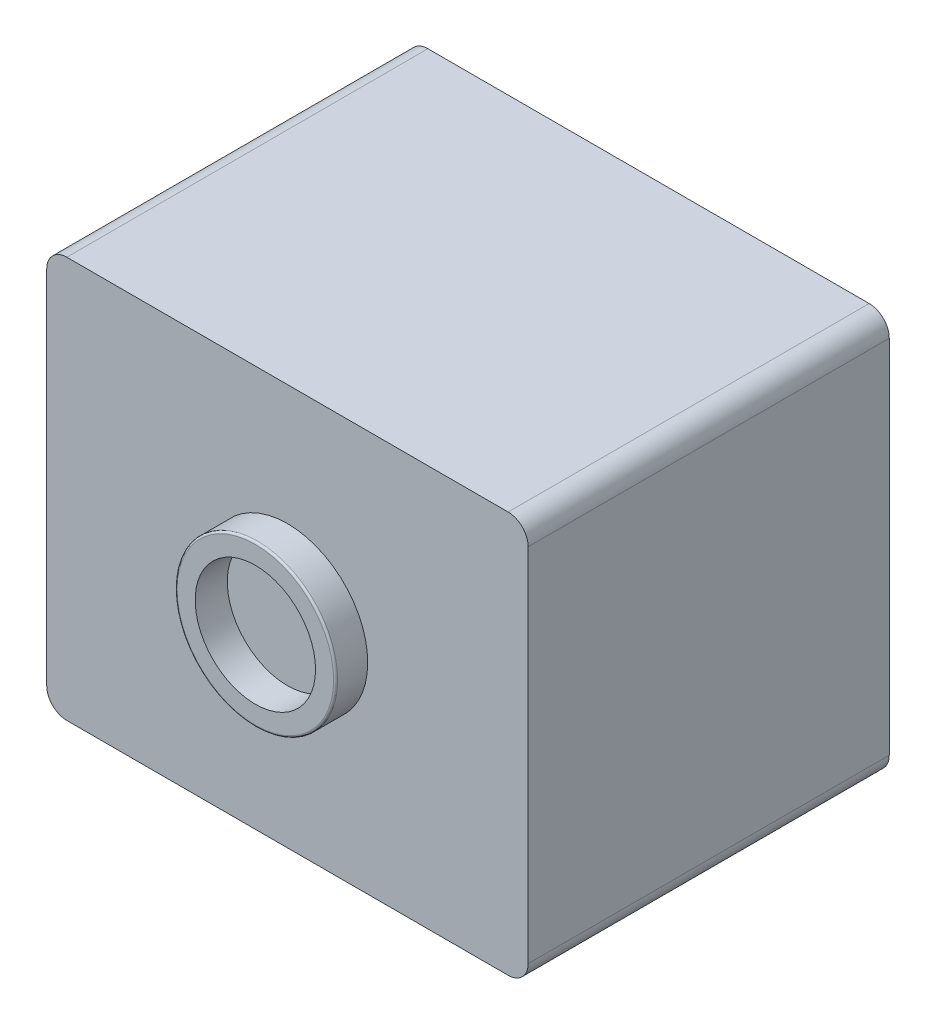
ISO-10303-21;
HEADER;
FILE_DESCRIPTION(('STEP AP214'),'2;1');
FILE_NAME('part.step','',(''),(''),'','','');
FILE_SCHEMA(('AUTOMOTIVE_DESIGN { 1 0 10303 214 1 1 1 1 }'));
ENDSEC;
DATA;
#1=APPLICATION_CONTEXT('core data for automotive mechanical design processes');
#2=APPLICATION_PROTOCOL_DEFINITION('international standard','automotive_design',2000,#1);
#3=PRODUCT_CONTEXT('',#1,'mechanical');
#4=PRODUCT('Part','Part','',(#3));
#5=PRODUCT_RELATED_PRODUCT_CATEGORY('part','',(#4));
#6=PRODUCT_DEFINITION_FORMATION('','',#4);
#7=PRODUCT_DEFINITION_CONTEXT('part definition',#1,'design');
#8=PRODUCT_DEFINITION('design','',#6,#7);
#9=PRODUCT_DEFINITION_SHAPE('','',#8);
#10=(LENGTH_UNIT() NAMED_UNIT(*) SI_UNIT(.MILLI.,.METRE.));
#11=(NAMED_UNIT(*) PLANE_ANGLE_UNIT() SI_UNIT($,.RADIAN.));
#12=(NAMED_UNIT(*) SI_UNIT($,.STERADIAN.) SOLID_ANGLE_UNIT());
#13=UNCERTAINTY_MEASURE_WITH_UNIT(LENGTH_MEASURE(1.E-05),#10,'distance_accuracy_value','');
#14=(GEOMETRIC_REPRESENTATION_CONTEXT(3) GLOBAL_UNCERTAINTY_ASSIGNED_CONTEXT((#13)) GLOBAL_UNIT_ASSIGNED_CONTEXT((#10,
#11,#12)) REPRESENTATION_CONTEXT('',''));
#15=CARTESIAN_POINT('',(0.,0.,0.));
#16=DIRECTION('',(0.,0.,1.));
#17=DIRECTION('',(1.,0.,0.));
#18=AXIS2_PLACEMENT_3D('',#15,#16,#17);
#19=CARTESIAN_POINT('',(6.,-5.,9.));
#20=DIRECTION('',(-1.,0.,0.));
#21=DIRECTION('',(0.,0.,1.));
#22=AXIS2_PLACEMENT_3D('',#19,#20,#21);
#23=PLANE('',#22);
#24=DIRECTION('',(0.,1.,0.));
#25=VECTOR('',#24,1.);
#26=CARTESIAN_POINT('',(6.,-5.,9.));
#27=LINE('',#26,#25);
#28=CARTESIAN_POINT('',(6.,-4.5,9.));
#29=VERTEX_POINT('',#28);
#30=CARTESIAN_POINT('',(6.,4.5,9.));
#31=VERTEX_POINT('',#30);
#32=EDGE_CURVE('E123',#29,#31,#27,.T.);
#33=ORIENTED_EDGE('',*,*,#32,.F.);
#34=DIRECTION('',(0.,0.,-1.));
#35=VECTOR('',#34,1.);
#36=CARTESIAN_POINT('',(6.,-4.5,9.));
#37=LINE('',#36,#35);
#38=CARTESIAN_POINT('',(6.,-4.5,0.));
#39=VERTEX_POINT('',#38);
#40=EDGE_CURVE('E108',#29,#39,#37,.T.);
#41=ORIENTED_EDGE('',*,*,#40,.T.);
#42=DIRECTION('',(0.,1.,0.));
#43=VECTOR('',#42,1.);
#44=CARTESIAN_POINT('',(6.,-5.,0.));
#45=LINE('',#44,#43);
#46=CARTESIAN_POINT('',(6.,4.5,0.));
#47=VERTEX_POINT('',#46);
#48=EDGE_CURVE('E120',#39,#47,#45,.T.);
#49=ORIENTED_EDGE('',*,*,#48,.T.);
#50=DIRECTION('',(0.,0.,-1.));
#51=VECTOR('',#50,1.);
#52=CARTESIAN_POINT('',(6.,4.5,9.));
#53=LINE('',#52,#51);
#54=EDGE_CURVE('E125',#47,#31,#53,.F.);
#55=ORIENTED_EDGE('',*,*,#54,.T.);
#56=EDGE_LOOP('',(#33,#41,#49,#55));
#57=FACE_BOUND('',#56,.T.);
#58=ADVANCED_FACE('F37',(#57),#23,.F.);
#59=CARTESIAN_POINT('',(-6.,5.,9.));
#60=DIRECTION('',(0.,-1.,0.));
#61=DIRECTION('',(0.,0.,-1.));
#62=AXIS2_PLACEMENT_3D('',#59,#60,#61);
#63=PLANE('',#62);
#64=DIRECTION('',(-1.,0.,0.));
#65=VECTOR('',#64,1.);
#66=CARTESIAN_POINT('',(-6.,5.,0.));
#67=LINE('',#66,#65);
#68=CARTESIAN_POINT('',(5.5,5.,0.));
#69=VERTEX_POINT('',#68);
#70=CARTESIAN_POINT('',(-5.5,5.,0.));
#71=VERTEX_POINT('',#70);
#72=EDGE_CURVE('E129',#69,#71,#67,.T.);
#73=ORIENTED_EDGE('',*,*,#72,.T.);
#74=DIRECTION('',(0.,0.,-1.));
#75=VECTOR('',#74,1.);
#76=CARTESIAN_POINT('',(-5.5,5.,9.));
#77=LINE('',#76,#75);
#78=CARTESIAN_POINT('',(-5.5,5.,9.));
#79=VERTEX_POINT('',#78);
#80=EDGE_CURVE('E167',#71,#79,#77,.F.);
#81=ORIENTED_EDGE('',*,*,#80,.T.);
#82=DIRECTION('',(-1.,0.,0.));
#83=VECTOR('',#82,1.);
#84=CARTESIAN_POINT('',(-6.,5.,9.));
#85=LINE('',#84,#83);
#86=CARTESIAN_POINT('',(5.5,5.,9.));
#87=VERTEX_POINT('',#86);
#88=EDGE_CURVE('E225',#87,#79,#85,.T.);
#89=ORIENTED_EDGE('',*,*,#88,.F.);
#90=DIRECTION('',(0.,0.,-1.));
#91=VECTOR('',#90,1.);
#92=CARTESIAN_POINT('',(5.5,5.,9.));
#93=LINE('',#92,#91);
#94=EDGE_CURVE('E164',#87,#69,#93,.T.);
#95=ORIENTED_EDGE('',*,*,#94,.T.);
#96=EDGE_LOOP('',(#73,#81,#89,#95));
#97=FACE_BOUND('',#96,.T.);
#98=ADVANCED_FACE('F194',(#97),#63,.F.);
#99=CARTESIAN_POINT('',(-6.,-5.,9.));
#100=DIRECTION('',(1.,0.,0.));
#101=DIRECTION('',(0.,0.,-1.));
#102=AXIS2_PLACEMENT_3D('',#99,#100,#101);
#103=PLANE('',#102);
#104=DIRECTION('',(0.,-1.,0.));
#105=VECTOR('',#104,1.);
#106=CARTESIAN_POINT('',(-6.,-5.,0.));
#107=LINE('',#106,#105);
#108=CARTESIAN_POINT('',(-6.,4.5,0.));
#109=VERTEX_POINT('',#108);
#110=CARTESIAN_POINT('',(-6.,-4.5,0.));
#111=VERTEX_POINT('',#110);
#112=EDGE_CURVE('E133',#109,#111,#107,.T.);
#113=ORIENTED_EDGE('',*,*,#112,.T.);
#114=DIRECTION('',(0.,0.,-1.));
#115=VECTOR('',#114,1.);
#116=CARTESIAN_POINT('',(-6.,-4.5,9.));
#117=LINE('',#116,#115);
#118=CARTESIAN_POINT('',(-6.,-4.5,9.));
#119=VERTEX_POINT('',#118);
#120=EDGE_CURVE('E52',#111,#119,#117,.F.);
#121=ORIENTED_EDGE('',*,*,#120,.T.);
#122=DIRECTION('',(0.,-1.,0.));
#123=VECTOR('',#122,1.);
#124=CARTESIAN_POINT('',(-6.,-5.,9.));
#125=LINE('',#124,#123);
#126=CARTESIAN_POINT('',(-6.,4.5,9.));
#127=VERTEX_POINT('',#126);
#128=EDGE_CURVE('E227',#127,#119,#125,.T.);
#129=ORIENTED_EDGE('',*,*,#128,.F.);
#130=DIRECTION('',(0.,0.,-1.));
#131=VECTOR('',#130,1.);
#132=CARTESIAN_POINT('',(-6.,4.5,9.));
#133=LINE('',#132,#131);
#134=EDGE_CURVE('E160',#127,#109,#133,.T.);
#135=ORIENTED_EDGE('',*,*,#134,.T.);
#136=EDGE_LOOP('',(#113,#121,#129,#135));
#137=FACE_BOUND('',#136,.T.);
#138=ADVANCED_FACE('F199',(#137),#103,.F.);
#139=CARTESIAN_POINT('',(-6.,-5.,9.));
#140=DIRECTION('',(0.,1.,0.));
#141=DIRECTION('',(0.,0.,1.));
#142=AXIS2_PLACEMENT_3D('',#139,#140,#141);
#143=PLANE('',#142);
#144=DIRECTION('',(1.,0.,0.));
#145=VECTOR('',#144,1.);
#146=CARTESIAN_POINT('',(-6.,-5.,0.));
#147=LINE('',#146,#145);
#148=CARTESIAN_POINT('',(-5.5,-5.,0.));
#149=VERTEX_POINT('',#148);
#150=CARTESIAN_POINT('',(5.5,-5.,0.));
#151=VERTEX_POINT('',#150);
#152=EDGE_CURVE('E143',#149,#151,#147,.T.);
#153=ORIENTED_EDGE('',*,*,#152,.T.);
#154=DIRECTION('',(0.,0.,-1.));
#155=VECTOR('',#154,1.);
#156=CARTESIAN_POINT('',(5.5,-5.,9.));
#157=LINE('',#156,#155);
#158=CARTESIAN_POINT('',(5.5,-5.,9.));
#159=VERTEX_POINT('',#158);
#160=EDGE_CURVE('E109',#151,#159,#157,.F.);
#161=ORIENTED_EDGE('',*,*,#160,.T.);
#162=DIRECTION('',(1.,0.,0.));
#163=VECTOR('',#162,1.);
#164=CARTESIAN_POINT('',(-6.,-5.,9.));
#165=LINE('',#164,#163);
#166=CARTESIAN_POINT('',(-5.5,-5.,9.));
#167=VERTEX_POINT('',#166);
#168=EDGE_CURVE('E139',#167,#159,#165,.T.);
#169=ORIENTED_EDGE('',*,*,#168,.F.);
#170=DIRECTION('',(0.,0.,-1.));
#171=VECTOR('',#170,1.);
#172=CARTESIAN_POINT('',(-5.5,-5.,9.));
#173=LINE('',#172,#171);
#174=EDGE_CURVE('E114',#167,#149,#173,.T.);
#175=ORIENTED_EDGE('',*,*,#174,.T.);
#176=EDGE_LOOP('',(#153,#161,#169,#175));
#177=FACE_BOUND('',#176,.T.);
#178=ADVANCED_FACE('F248',(#177),#143,.F.);
#179=CARTESIAN_POINT('',(0.,0.,9.));
#180=DIRECTION('',(0.,0.,-1.));
#181=DIRECTION('',(-1.,0.,0.));
#182=AXIS2_PLACEMENT_3D('',#179,#180,#181);
#183=PLANE('',#182);
#184=CARTESIAN_POINT('',(0.,0.,9.));
#185=DIRECTION('',(0.,0.,-1.));
#186=DIRECTION('',(-1.,0.,0.));
#187=AXIS2_PLACEMENT_3D('',#184,#185,#186);
#188=CIRCLE('',#187,2.);
#189=CARTESIAN_POINT('',(-2.,0.,9.));
#190=VERTEX_POINT('',#189);
#191=EDGE_CURVE('E169',#190,#190,#188,.F.);
#192=ORIENTED_EDGE('',*,*,#191,.F.);
#193=EDGE_LOOP('',(#192));
#194=FACE_BOUND('',#193,.T.);
#195=ORIENTED_EDGE('',*,*,#168,.T.);
#196=CARTESIAN_POINT('',(5.5,-4.5,9.));
#197=DIRECTION('',(0.,0.,-1.));
#198=DIRECTION('',(-1.,0.,0.));
#199=AXIS2_PLACEMENT_3D('',#196,#197,#198);
#200=CIRCLE('',#199,0.5);
#201=EDGE_CURVE('E158',#159,#29,#200,.F.);
#202=ORIENTED_EDGE('',*,*,#201,.T.);
#203=ORIENTED_EDGE('',*,*,#32,.T.);
#204=CARTESIAN_POINT('',(5.5,4.5,9.));
#205=DIRECTION('',(0.,0.,-1.));
#206=DIRECTION('',(-1.,0.,0.));
#207=AXIS2_PLACEMENT_3D('',#204,#205,#206);
#208=CIRCLE('',#207,0.5);
#209=EDGE_CURVE('E153',#31,#87,#208,.F.);
#210=ORIENTED_EDGE('',*,*,#209,.T.);
#211=ORIENTED_EDGE('',*,*,#88,.T.);
#212=CARTESIAN_POINT('',(-5.5,4.5,9.));
#213=DIRECTION('',(0.,0.,-1.));
#214=DIRECTION('',(-1.,0.,0.));
#215=AXIS2_PLACEMENT_3D('',#212,#213,#214);
#216=CIRCLE('',#215,0.5);
#217=EDGE_CURVE('E59',#79,#127,#216,.F.);
#218=ORIENTED_EDGE('',*,*,#217,.T.);
#219=ORIENTED_EDGE('',*,*,#128,.T.);
#220=CARTESIAN_POINT('',(-5.5,-4.5,9.));
#221=DIRECTION('',(0.,0.,-1.));
#222=DIRECTION('',(-1.,0.,0.));
#223=AXIS2_PLACEMENT_3D('',#220,#221,#222);
#224=CIRCLE('',#223,0.5);
#225=EDGE_CURVE('E156',#119,#167,#224,.F.);
#226=ORIENTED_EDGE('',*,*,#225,.T.);
#227=EDGE_LOOP('',(#195,#202,#203,#210,#211,#218,#219,#226));
#228=FACE_BOUND('',#227,.T.);
#229=ADVANCED_FACE('F191',(#194,#228),#183,.F.);
#230=CARTESIAN_POINT('',(0.,0.,0.));
#231=DIRECTION('',(0.,0.,-1.));
#232=DIRECTION('',(-1.,0.,0.));
#233=AXIS2_PLACEMENT_3D('',#230,#231,#232);
#234=PLANE('',#233);
#235=CARTESIAN_POINT('',(0.,0.,0.));
#236=DIRECTION('',(0.,0.,-1.));
#237=DIRECTION('',(-1.,0.,0.));
#238=AXIS2_PLACEMENT_3D('',#235,#236,#237);
#239=CIRCLE('',#238,2.);
#240=CARTESIAN_POINT('',(-2.,0.,0.));
#241=VERTEX_POINT('',#240);
#242=EDGE_CURVE('E234',#241,#241,#239,.T.);
#243=ORIENTED_EDGE('',*,*,#242,.F.);
#244=EDGE_LOOP('',(#243));
#245=FACE_BOUND('',#244,.T.);
#246=ORIENTED_EDGE('',*,*,#48,.F.);
#247=CARTESIAN_POINT('',(5.5,-4.5,0.));
#248=DIRECTION('',(0.,0.,-1.));
#249=DIRECTION('',(-1.,0.,0.));
#250=AXIS2_PLACEMENT_3D('',#247,#248,#249);
#251=CIRCLE('',#250,0.5);
#252=EDGE_CURVE('E104',#39,#151,#251,.T.);
#253=ORIENTED_EDGE('',*,*,#252,.T.);
#254=ORIENTED_EDGE('',*,*,#152,.F.);
#255=CARTESIAN_POINT('',(-5.5,-4.5,0.));
#256=DIRECTION('',(0.,0.,-1.));
#257=DIRECTION('',(-1.,0.,0.));
#258=AXIS2_PLACEMENT_3D('',#255,#256,#257);
#259=CIRCLE('',#258,0.5);
#260=EDGE_CURVE('E115',#149,#111,#259,.T.);
#261=ORIENTED_EDGE('',*,*,#260,.T.);
#262=ORIENTED_EDGE('',*,*,#112,.F.);
#263=CARTESIAN_POINT('',(-5.5,4.5,0.));
#264=DIRECTION('',(0.,0.,-1.));
#265=DIRECTION('',(-1.,0.,0.));
#266=AXIS2_PLACEMENT_3D('',#263,#264,#265);
#267=CIRCLE('',#266,0.5);
#268=EDGE_CURVE('E147',#109,#71,#267,.T.);
#269=ORIENTED_EDGE('',*,*,#268,.T.);
#270=ORIENTED_EDGE('',*,*,#72,.F.);
#271=CARTESIAN_POINT('',(5.5,4.5,0.));
#272=DIRECTION('',(0.,0.,-1.));
#273=DIRECTION('',(-1.,0.,0.));
#274=AXIS2_PLACEMENT_3D('',#271,#272,#273);
#275=CIRCLE('',#274,0.5);
#276=EDGE_CURVE('E124',#69,#47,#275,.T.);
#277=ORIENTED_EDGE('',*,*,#276,.T.);
#278=EDGE_LOOP('',(#246,#253,#254,#261,#262,#269,#270,#277));
#279=FACE_BOUND('',#278,.T.);
#280=ADVANCED_FACE('F127',(#245,#279),#234,.T.);
#281=CARTESIAN_POINT('',(5.5,-4.5,9.));
#282=DIRECTION('',(0.,0.,-1.));
#283=DIRECTION('',(-1.,0.,0.));
#284=AXIS2_PLACEMENT_3D('',#281,#282,#283);
#285=CYLINDRICAL_SURFACE('',#284,0.5);
#286=ORIENTED_EDGE('',*,*,#201,.F.);
#287=ORIENTED_EDGE('',*,*,#160,.F.);
#288=ORIENTED_EDGE('',*,*,#252,.F.);
#289=ORIENTED_EDGE('',*,*,#40,.F.);
#290=EDGE_LOOP('',(#286,#287,#288,#289));
#291=FACE_BOUND('',#290,.T.);
#292=ADVANCED_FACE('F107',(#291),#285,.T.);
#293=CARTESIAN_POINT('',(-5.5,-4.5,9.));
#294=DIRECTION('',(0.,0.,-1.));
#295=DIRECTION('',(-1.,0.,0.));
#296=AXIS2_PLACEMENT_3D('',#293,#294,#295);
#297=CYLINDRICAL_SURFACE('',#296,0.5);
#298=ORIENTED_EDGE('',*,*,#225,.F.);
#299=ORIENTED_EDGE('',*,*,#120,.F.);
#300=ORIENTED_EDGE('',*,*,#260,.F.);
#301=ORIENTED_EDGE('',*,*,#174,.F.);
#302=EDGE_LOOP('',(#298,#299,#300,#301));
#303=FACE_BOUND('',#302,.T.);
#304=ADVANCED_FACE('F206',(#303),#297,.T.);
#305=CARTESIAN_POINT('',(-5.5,4.5,9.));
#306=DIRECTION('',(0.,0.,-1.));
#307=DIRECTION('',(-1.,0.,0.));
#308=AXIS2_PLACEMENT_3D('',#305,#306,#307);
#309=CYLINDRICAL_SURFACE('',#308,0.5);
#310=ORIENTED_EDGE('',*,*,#217,.F.);
#311=ORIENTED_EDGE('',*,*,#80,.F.);
#312=ORIENTED_EDGE('',*,*,#268,.F.);
#313=ORIENTED_EDGE('',*,*,#134,.F.);
#314=EDGE_LOOP('',(#310,#311,#312,#313));
#315=FACE_BOUND('',#314,.T.);
#316=ADVANCED_FACE('F209',(#315),#309,.T.);
#317=CARTESIAN_POINT('',(5.5,4.5,9.));
#318=DIRECTION('',(0.,0.,-1.));
#319=DIRECTION('',(-1.,0.,0.));
#320=AXIS2_PLACEMENT_3D('',#317,#318,#319);
#321=CYLINDRICAL_SURFACE('',#320,0.5);
#322=ORIENTED_EDGE('',*,*,#209,.F.);
#323=ORIENTED_EDGE('',*,*,#54,.F.);
#324=ORIENTED_EDGE('',*,*,#276,.F.);
#325=ORIENTED_EDGE('',*,*,#94,.F.);
#326=EDGE_LOOP('',(#322,#323,#324,#325));
#327=FACE_BOUND('',#326,.T.);
#328=ADVANCED_FACE('F212',(#327),#321,.T.);
#329=CARTESIAN_POINT('',(0.,0.,9.8));
#330=DIRECTION('',(0.,0.,1.));
#331=DIRECTION('',(1.,0.,0.));
#332=AXIS2_PLACEMENT_3D('',#329,#330,#331);
#333=PLANE('',#332);
#334=CARTESIAN_POINT('',(0.,0.,9.8));
#335=DIRECTION('',(0.,0.,1.));
#336=DIRECTION('',(1.,0.,0.));
#337=AXIS2_PLACEMENT_3D('',#334,#335,#336);
#338=CIRCLE('',#337,1.95);
#339=CARTESIAN_POINT('',(1.95,0.,9.8));
#340=VERTEX_POINT('',#339);
#341=EDGE_CURVE('E45',#340,#340,#338,.T.);
#342=ORIENTED_EDGE('',*,*,#341,.T.);
#343=EDGE_LOOP('',(#342));
#344=FACE_BOUND('',#343,.T.);
#345=CARTESIAN_POINT('',(0.,0.,9.8));
#346=DIRECTION('',(0.,0.,1.));
#347=DIRECTION('',(1.,0.,0.));
#348=AXIS2_PLACEMENT_3D('',#345,#346,#347);
#349=CIRCLE('',#348,1.5);
#350=CARTESIAN_POINT('',(1.5,0.,9.8));
#351=VERTEX_POINT('',#350);
#352=EDGE_CURVE('E130',#351,#351,#349,.T.);
#353=ORIENTED_EDGE('',*,*,#352,.F.);
#354=EDGE_LOOP('',(#353));
#355=FACE_BOUND('',#354,.T.);
#356=ADVANCED_FACE('F174',(#344,#355),#333,.T.);
#357=CARTESIAN_POINT('',(0.,0.,9.8));
#358=DIRECTION('',(0.,0.,-1.));
#359=DIRECTION('',(-1.,0.,0.));
#360=AXIS2_PLACEMENT_3D('',#357,#358,#359);
#361=CYLINDRICAL_SURFACE('',#360,2.);
#362=CARTESIAN_POINT('',(0.,0.,9.75));
#363=DIRECTION('',(0.,0.,1.));
#364=DIRECTION('',(1.,0.,0.));
#365=AXIS2_PLACEMENT_3D('',#362,#363,#364);
#366=CIRCLE('',#365,2.);
#367=CARTESIAN_POINT('',(2.,0.,9.75));
#368=VERTEX_POINT('',#367);
#369=EDGE_CURVE('E11',#368,#368,#366,.F.);
#370=ORIENTED_EDGE('',*,*,#369,.T.);
#371=EDGE_LOOP('',(#370));
#372=FACE_BOUND('',#371,.T.);
#373=ORIENTED_EDGE('',*,*,#191,.T.);
#374=EDGE_LOOP('',(#373));
#375=FACE_BOUND('',#374,.T.);
#376=ADVANCED_FACE('F219',(#372,#375),#361,.T.);
#377=CARTESIAN_POINT('',(0.,0.,9.8));
#378=DIRECTION('',(0.,0.,-1.));
#379=DIRECTION('',(-1.,0.,0.));
#380=AXIS2_PLACEMENT_3D('',#377,#378,#379);
#381=CYLINDRICAL_SURFACE('',#380,1.5);
#382=ORIENTED_EDGE('',*,*,#352,.T.);
#383=EDGE_LOOP('',(#382));
#384=FACE_BOUND('',#383,.T.);
#385=CARTESIAN_POINT('',(0.,0.,9.));
#386=DIRECTION('',(0.,0.,1.));
#387=DIRECTION('',(1.,0.,0.));
#388=AXIS2_PLACEMENT_3D('',#385,#386,#387);
#389=CIRCLE('',#388,1.5);
#390=CARTESIAN_POINT('',(1.5,0.,9.));
#391=VERTEX_POINT('',#390);
#392=EDGE_CURVE('E136',#391,#391,#389,.T.);
#393=ORIENTED_EDGE('',*,*,#392,.F.);
#394=EDGE_LOOP('',(#393));
#395=FACE_BOUND('',#394,.T.);
#396=ADVANCED_FACE('F188',(#384,#395),#381,.F.);
#397=ORIENTED_EDGE('',*,*,#392,.T.);
#398=EDGE_LOOP('',(#397));
#399=FACE_BOUND('',#398,.T.);
#400=ADVANCED_FACE('F179',(#399),#183,.F.);
#401=CARTESIAN_POINT('',(0.,0.,9.75));
#402=DIRECTION('',(0.,0.,1.));
#403=DIRECTION('',(1.,0.,0.));
#404=AXIS2_PLACEMENT_3D('',#401,#402,#403);
#405=TOROIDAL_SURFACE('',#404,1.95,0.05);
#406=ORIENTED_EDGE('',*,*,#369,.F.);
#407=EDGE_LOOP('',(#406));
#408=FACE_BOUND('',#407,.T.);
#409=ORIENTED_EDGE('',*,*,#341,.F.);
#410=EDGE_LOOP('',(#409));
#411=FACE_BOUND('',#410,.T.);
#412=ADVANCED_FACE('F39',(#408,#411),#405,.T.);
#413=CARTESIAN_POINT('',(0.,0.,0.1));
#414=DIRECTION('',(0.,0.,-1.));
#415=DIRECTION('',(-1.,0.,0.));
#416=AXIS2_PLACEMENT_3D('',#413,#414,#415);
#417=CYLINDRICAL_SURFACE('',#416,2.);
#418=CARTESIAN_POINT('',(0.,0.,0.1));
#419=DIRECTION('',(0.,0.,-1.));
#420=DIRECTION('',(-1.,0.,0.));
#421=AXIS2_PLACEMENT_3D('',#418,#419,#420);
#422=CIRCLE('',#421,2.);
#423=CARTESIAN_POINT('',(-2.,0.,0.1));
#424=VERTEX_POINT('',#423);
#425=EDGE_CURVE('E232',#424,#424,#422,.T.);
#426=ORIENTED_EDGE('',*,*,#425,.F.);
#427=EDGE_LOOP('',(#426));
#428=FACE_BOUND('',#427,.T.);
#429=ORIENTED_EDGE('',*,*,#242,.T.);
#430=EDGE_LOOP('',(#429));
#431=FACE_BOUND('',#430,.T.);
#432=ADVANCED_FACE('F178',(#428,#431),#417,.F.);
#433=CARTESIAN_POINT('',(0.,0.,0.1));
#434=DIRECTION('',(0.,0.,-1.));
#435=DIRECTION('',(-1.,0.,0.));
#436=AXIS2_PLACEMENT_3D('',#433,#434,#435);
#437=PLANE('',#436);
#438=ORIENTED_EDGE('',*,*,#425,.T.);
#439=EDGE_LOOP('',(#438));
#440=FACE_BOUND('',#439,.T.);
#441=ADVANCED_FACE('F185',(#440),#437,.T.);
#442=CLOSED_SHELL('',(#58,#98,#138,#178,#229,#280,#292,#304,#316,#328,#356,#376,#396,#400,#412,
#432,#441));
#443=MANIFOLD_SOLID_BREP('B2',#442);
#444=ADVANCED_BREP_SHAPE_REPRESENTATION('',(#18,#443),#14);
#445=SHAPE_DEFINITION_REPRESENTATION(#9,#444);
ENDSEC;
END-ISO-10303-21;
